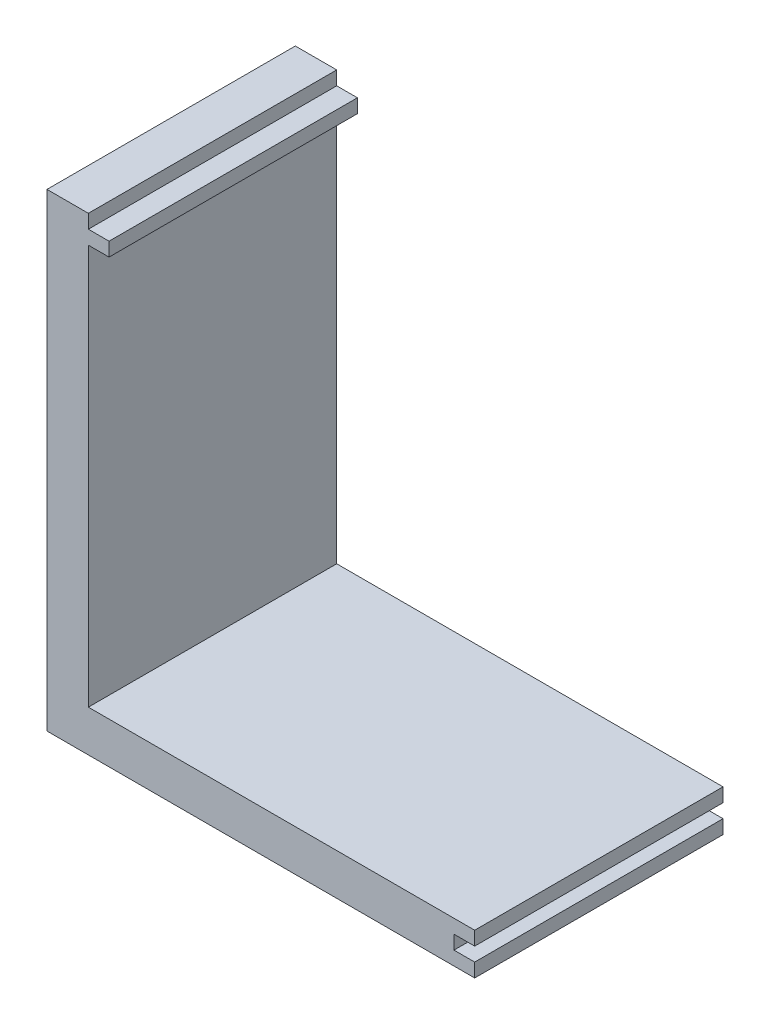
ISO-10303-21;
HEADER;
FILE_DESCRIPTION(('STEP AP214'),'2;1');
FILE_NAME('part.step','',(''),(''),'','','');
FILE_SCHEMA(('AUTOMOTIVE_DESIGN { 1 0 10303 214 1 1 1 1 }'));
ENDSEC;
DATA;
#1=APPLICATION_CONTEXT('core data for automotive mechanical design processes');
#2=APPLICATION_PROTOCOL_DEFINITION('international standard','automotive_design',2000,#1);
#3=PRODUCT_CONTEXT('',#1,'mechanical');
#4=PRODUCT('Part','Part','',(#3));
#5=PRODUCT_RELATED_PRODUCT_CATEGORY('part','',(#4));
#6=PRODUCT_DEFINITION_FORMATION('','',#4);
#7=PRODUCT_DEFINITION_CONTEXT('part definition',#1,'design');
#8=PRODUCT_DEFINITION('design','',#6,#7);
#9=PRODUCT_DEFINITION_SHAPE('','',#8);
#10=(LENGTH_UNIT() NAMED_UNIT(*) SI_UNIT(.MILLI.,.METRE.));
#11=(NAMED_UNIT(*) PLANE_ANGLE_UNIT() SI_UNIT($,.RADIAN.));
#12=(NAMED_UNIT(*) SI_UNIT($,.STERADIAN.) SOLID_ANGLE_UNIT());
#13=UNCERTAINTY_MEASURE_WITH_UNIT(LENGTH_MEASURE(1.E-05),#10,'distance_accuracy_value','');
#14=(GEOMETRIC_REPRESENTATION_CONTEXT(3) GLOBAL_UNCERTAINTY_ASSIGNED_CONTEXT((#13)) GLOBAL_UNIT_ASSIGNED_CONTEXT((#10,
#11,#12)) REPRESENTATION_CONTEXT('',''));
#15=CARTESIAN_POINT('',(0.,0.,0.));
#16=DIRECTION('',(0.,0.,1.));
#17=DIRECTION('',(1.,0.,0.));
#18=AXIS2_PLACEMENT_3D('',#15,#16,#17);
#19=CARTESIAN_POINT('',(0.,0.,18.));
#20=DIRECTION('',(-1.,0.,0.));
#21=DIRECTION('',(0.,0.,1.));
#22=AXIS2_PLACEMENT_3D('',#19,#20,#21);
#23=PLANE('',#22);
#24=DIRECTION('',(0.,1.,0.));
#25=VECTOR('',#24,1.);
#26=CARTESIAN_POINT('',(0.,0.,0.));
#27=LINE('',#26,#25);
#28=CARTESIAN_POINT('',(0.,0.,0.));
#29=VERTEX_POINT('',#28);
#30=CARTESIAN_POINT('',(0.,29.,0.));
#31=VERTEX_POINT('',#30);
#32=EDGE_CURVE('E221',#29,#31,#27,.T.);
#33=ORIENTED_EDGE('',*,*,#32,.T.);
#34=DIRECTION('',(0.,0.,1.));
#35=VECTOR('',#34,1.);
#36=CARTESIAN_POINT('',(0.,29.,0.));
#37=LINE('',#36,#35);
#38=CARTESIAN_POINT('',(0.,29.,18.));
#39=VERTEX_POINT('',#38);
#40=EDGE_CURVE('E64',#31,#39,#37,.T.);
#41=ORIENTED_EDGE('',*,*,#40,.T.);
#42=DIRECTION('',(0.,1.,0.));
#43=VECTOR('',#42,1.);
#44=CARTESIAN_POINT('',(0.,0.,18.));
#45=LINE('',#44,#43);
#46=CARTESIAN_POINT('',(0.,0.,18.));
#47=VERTEX_POINT('',#46);
#48=EDGE_CURVE('E205',#47,#39,#45,.T.);
#49=ORIENTED_EDGE('',*,*,#48,.F.);
#50=DIRECTION('',(0.,0.,-1.));
#51=VECTOR('',#50,1.);
#52=CARTESIAN_POINT('',(0.,0.,18.));
#53=LINE('',#52,#51);
#54=EDGE_CURVE('E49',#47,#29,#53,.T.);
#55=ORIENTED_EDGE('',*,*,#54,.T.);
#56=EDGE_LOOP('',(#33,#41,#49,#55));
#57=FACE_BOUND('',#56,.T.);
#58=ADVANCED_FACE('F41',(#57),#23,.F.);
#59=CARTESIAN_POINT('',(28.,0.,18.));
#60=DIRECTION('',(-1.,0.,0.));
#61=DIRECTION('',(0.,0.,1.));
#62=AXIS2_PLACEMENT_3D('',#59,#60,#61);
#63=PLANE('',#62);
#64=DIRECTION('',(0.,1.,0.));
#65=VECTOR('',#64,1.);
#66=CARTESIAN_POINT('',(28.,0.,0.));
#67=LINE('',#66,#65);
#68=CARTESIAN_POINT('',(28.,-3.,0.));
#69=VERTEX_POINT('',#68);
#70=CARTESIAN_POINT('',(28.,-2.,0.));
#71=VERTEX_POINT('',#70);
#72=EDGE_CURVE('E204',#69,#71,#67,.T.);
#73=ORIENTED_EDGE('',*,*,#72,.T.);
#74=DIRECTION('',(0.,0.,1.));
#75=VECTOR('',#74,1.);
#76=CARTESIAN_POINT('',(28.,-2.,18.));
#77=LINE('',#76,#75);
#78=CARTESIAN_POINT('',(28.,-2.,18.));
#79=VERTEX_POINT('',#78);
#80=EDGE_CURVE('E197',#71,#79,#77,.T.);
#81=ORIENTED_EDGE('',*,*,#80,.T.);
#82=DIRECTION('',(0.,1.,0.));
#83=VECTOR('',#82,1.);
#84=CARTESIAN_POINT('',(28.,0.,18.));
#85=LINE('',#84,#83);
#86=CARTESIAN_POINT('',(28.,-3.,18.));
#87=VERTEX_POINT('',#86);
#88=EDGE_CURVE('E214',#87,#79,#85,.T.);
#89=ORIENTED_EDGE('',*,*,#88,.F.);
#90=DIRECTION('',(0.,0.,-1.));
#91=VECTOR('',#90,1.);
#92=CARTESIAN_POINT('',(28.,-3.,18.));
#93=LINE('',#92,#91);
#94=EDGE_CURVE('E235',#87,#69,#93,.T.);
#95=ORIENTED_EDGE('',*,*,#94,.T.);
#96=EDGE_LOOP('',(#73,#81,#89,#95));
#97=FACE_BOUND('',#96,.T.);
#98=ADVANCED_FACE('F271',(#97),#63,.F.);
#99=CARTESIAN_POINT('',(0.,0.,18.));
#100=DIRECTION('',(0.,-1.,0.));
#101=DIRECTION('',(1.,0.,0.));
#102=AXIS2_PLACEMENT_3D('',#99,#100,#101);
#103=PLANE('',#102);
#104=DIRECTION('',(-1.,0.,0.));
#105=VECTOR('',#104,1.);
#106=CARTESIAN_POINT('',(0.,0.,0.));
#107=LINE('',#106,#105);
#108=CARTESIAN_POINT('',(28.,0.,0.));
#109=VERTEX_POINT('',#108);
#110=EDGE_CURVE('E200',#109,#29,#107,.T.);
#111=ORIENTED_EDGE('',*,*,#110,.T.);
#112=ORIENTED_EDGE('',*,*,#54,.F.);
#113=DIRECTION('',(-1.,0.,0.));
#114=VECTOR('',#113,1.);
#115=CARTESIAN_POINT('',(0.,0.,18.));
#116=LINE('',#115,#114);
#117=CARTESIAN_POINT('',(28.,0.,18.));
#118=VERTEX_POINT('',#117);
#119=EDGE_CURVE('E201',#118,#47,#116,.T.);
#120=ORIENTED_EDGE('',*,*,#119,.F.);
#121=DIRECTION('',(0.,0.,-1.));
#122=VECTOR('',#121,1.);
#123=CARTESIAN_POINT('',(28.,0.,18.));
#124=LINE('',#123,#122);
#125=EDGE_CURVE('E217',#118,#109,#124,.T.);
#126=ORIENTED_EDGE('',*,*,#125,.T.);
#127=EDGE_LOOP('',(#111,#112,#120,#126));
#128=FACE_BOUND('',#127,.T.);
#129=ADVANCED_FACE('F43',(#128),#103,.F.);
#130=CARTESIAN_POINT('',(0.,30.,18.));
#131=VERTEX_POINT('',#130);
#132=CARTESIAN_POINT('',(0.,31.,18.));
#133=VERTEX_POINT('',#132);
#134=EDGE_CURVE('E56',#131,#133,#45,.T.);
#135=ORIENTED_EDGE('',*,*,#134,.F.);
#136=DIRECTION('',(0.,0.,1.));
#137=VECTOR('',#136,1.);
#138=CARTESIAN_POINT('',(0.,30.,0.));
#139=LINE('',#138,#137);
#140=CARTESIAN_POINT('',(0.,30.,0.));
#141=VERTEX_POINT('',#140);
#142=EDGE_CURVE('E175',#141,#131,#139,.T.);
#143=ORIENTED_EDGE('',*,*,#142,.F.);
#144=CARTESIAN_POINT('',(0.,31.,0.));
#145=VERTEX_POINT('',#144);
#146=EDGE_CURVE('E220',#141,#145,#27,.T.);
#147=ORIENTED_EDGE('',*,*,#146,.T.);
#148=DIRECTION('',(0.,0.,-1.));
#149=VECTOR('',#148,1.);
#150=CARTESIAN_POINT('',(0.,31.,18.));
#151=LINE('',#150,#149);
#152=EDGE_CURVE('E244',#133,#145,#151,.T.);
#153=ORIENTED_EDGE('',*,*,#152,.F.);
#154=EDGE_LOOP('',(#135,#143,#147,#153));
#155=FACE_BOUND('',#154,.T.);
#156=ADVANCED_FACE('F287',(#155),#23,.F.);
#157=CARTESIAN_POINT('',(0.,31.,18.));
#158=DIRECTION('',(0.,-1.,0.));
#159=DIRECTION('',(0.,0.,-1.));
#160=AXIS2_PLACEMENT_3D('',#157,#158,#159);
#161=PLANE('',#160);
#162=DIRECTION('',(-1.,0.,0.));
#163=VECTOR('',#162,1.);
#164=CARTESIAN_POINT('',(0.,31.,0.));
#165=LINE('',#164,#163);
#166=CARTESIAN_POINT('',(-3.,31.,0.));
#167=VERTEX_POINT('',#166);
#168=EDGE_CURVE('E223',#145,#167,#165,.T.);
#169=ORIENTED_EDGE('',*,*,#168,.T.);
#170=DIRECTION('',(0.,0.,-1.));
#171=VECTOR('',#170,1.);
#172=CARTESIAN_POINT('',(-3.,31.,18.));
#173=LINE('',#172,#171);
#174=CARTESIAN_POINT('',(-3.,31.,18.));
#175=VERTEX_POINT('',#174);
#176=EDGE_CURVE('E241',#175,#167,#173,.T.);
#177=ORIENTED_EDGE('',*,*,#176,.F.);
#178=DIRECTION('',(-1.,0.,0.));
#179=VECTOR('',#178,1.);
#180=CARTESIAN_POINT('',(0.,31.,18.));
#181=LINE('',#180,#179);
#182=EDGE_CURVE('E207',#133,#175,#181,.T.);
#183=ORIENTED_EDGE('',*,*,#182,.F.);
#184=ORIENTED_EDGE('',*,*,#152,.T.);
#185=EDGE_LOOP('',(#169,#177,#183,#184));
#186=FACE_BOUND('',#185,.T.);
#187=ADVANCED_FACE('F286',(#186),#161,.F.);
#188=CARTESIAN_POINT('',(-3.,-3.,18.));
#189=DIRECTION('',(1.,0.,0.));
#190=DIRECTION('',(0.,1.,0.));
#191=AXIS2_PLACEMENT_3D('',#188,#189,#190);
#192=PLANE('',#191);
#193=DIRECTION('',(0.,-1.,0.));
#194=VECTOR('',#193,1.);
#195=CARTESIAN_POINT('',(-3.,-3.,0.));
#196=LINE('',#195,#194);
#197=CARTESIAN_POINT('',(-3.,-3.,0.));
#198=VERTEX_POINT('',#197);
#199=EDGE_CURVE('E225',#167,#198,#196,.T.);
#200=ORIENTED_EDGE('',*,*,#199,.T.);
#201=DIRECTION('',(0.,0.,-1.));
#202=VECTOR('',#201,1.);
#203=CARTESIAN_POINT('',(-3.,-3.,18.));
#204=LINE('',#203,#202);
#205=CARTESIAN_POINT('',(-3.,-3.,18.));
#206=VERTEX_POINT('',#205);
#207=EDGE_CURVE('E238',#206,#198,#204,.T.);
#208=ORIENTED_EDGE('',*,*,#207,.F.);
#209=DIRECTION('',(0.,-1.,0.));
#210=VECTOR('',#209,1.);
#211=CARTESIAN_POINT('',(-3.,-3.,18.));
#212=LINE('',#211,#210);
#213=EDGE_CURVE('E209',#175,#206,#212,.T.);
#214=ORIENTED_EDGE('',*,*,#213,.F.);
#215=ORIENTED_EDGE('',*,*,#176,.T.);
#216=EDGE_LOOP('',(#200,#208,#214,#215));
#217=FACE_BOUND('',#216,.T.);
#218=ADVANCED_FACE('F281',(#217),#192,.F.);
#219=CARTESIAN_POINT('',(0.,-3.,18.));
#220=DIRECTION('',(0.,1.,0.));
#221=DIRECTION('',(-1.,0.,0.));
#222=AXIS2_PLACEMENT_3D('',#219,#220,#221);
#223=PLANE('',#222);
#224=DIRECTION('',(1.,0.,0.));
#225=VECTOR('',#224,1.);
#226=CARTESIAN_POINT('',(0.,-3.,0.));
#227=LINE('',#226,#225);
#228=EDGE_CURVE('E228',#198,#69,#227,.T.);
#229=ORIENTED_EDGE('',*,*,#228,.T.);
#230=ORIENTED_EDGE('',*,*,#94,.F.);
#231=DIRECTION('',(1.,0.,0.));
#232=VECTOR('',#231,1.);
#233=CARTESIAN_POINT('',(0.,-3.,18.));
#234=LINE('',#233,#232);
#235=EDGE_CURVE('E211',#206,#87,#234,.T.);
#236=ORIENTED_EDGE('',*,*,#235,.F.);
#237=ORIENTED_EDGE('',*,*,#207,.T.);
#238=EDGE_LOOP('',(#229,#230,#236,#237));
#239=FACE_BOUND('',#238,.T.);
#240=ADVANCED_FACE('F276',(#239),#223,.F.);
#241=CARTESIAN_POINT('',(28.,-0.999999999999997,18.));
#242=VERTEX_POINT('',#241);
#243=EDGE_CURVE('E213',#242,#118,#85,.T.);
#244=ORIENTED_EDGE('',*,*,#243,.F.);
#245=DIRECTION('',(0.,0.,-1.));
#246=VECTOR('',#245,1.);
#247=CARTESIAN_POINT('',(28.,-0.999999999999997,18.));
#248=LINE('',#247,#246);
#249=CARTESIAN_POINT('',(28.,-0.999999999999997,0.));
#250=VERTEX_POINT('',#249);
#251=EDGE_CURVE('E192',#242,#250,#248,.T.);
#252=ORIENTED_EDGE('',*,*,#251,.T.);
#253=EDGE_CURVE('E230',#250,#109,#67,.T.);
#254=ORIENTED_EDGE('',*,*,#253,.T.);
#255=ORIENTED_EDGE('',*,*,#125,.F.);
#256=EDGE_LOOP('',(#244,#252,#254,#255));
#257=FACE_BOUND('',#256,.T.);
#258=ADVANCED_FACE('F256',(#257),#63,.F.);
#259=CARTESIAN_POINT('',(0.,0.,18.));
#260=DIRECTION('',(0.,0.,-1.));
#261=DIRECTION('',(-1.,0.,0.));
#262=AXIS2_PLACEMENT_3D('',#259,#260,#261);
#263=PLANE('',#262);
#264=ORIENTED_EDGE('',*,*,#88,.T.);
#265=DIRECTION('',(1.,0.,0.));
#266=VECTOR('',#265,1.);
#267=CARTESIAN_POINT('',(26.5,-2.,18.));
#268=LINE('',#267,#266);
#269=CARTESIAN_POINT('',(26.5,-2.,18.));
#270=VERTEX_POINT('',#269);
#271=EDGE_CURVE('E182',#270,#79,#268,.T.);
#272=ORIENTED_EDGE('',*,*,#271,.F.);
#273=DIRECTION('',(0.,-1.,0.));
#274=VECTOR('',#273,1.);
#275=CARTESIAN_POINT('',(26.5,-2.,18.));
#276=LINE('',#275,#274);
#277=CARTESIAN_POINT('',(26.5,-0.999999999999997,18.));
#278=VERTEX_POINT('',#277);
#279=EDGE_CURVE('E186',#278,#270,#276,.T.);
#280=ORIENTED_EDGE('',*,*,#279,.F.);
#281=DIRECTION('',(-1.,0.,0.));
#282=VECTOR('',#281,1.);
#283=CARTESIAN_POINT('',(26.5,-0.999999999999997,18.));
#284=LINE('',#283,#282);
#285=EDGE_CURVE('E174',#242,#278,#284,.T.);
#286=ORIENTED_EDGE('',*,*,#285,.F.);
#287=ORIENTED_EDGE('',*,*,#243,.T.);
#288=ORIENTED_EDGE('',*,*,#119,.T.);
#289=ORIENTED_EDGE('',*,*,#48,.T.);
#290=DIRECTION('',(1.,0.,0.));
#291=VECTOR('',#290,1.);
#292=CARTESIAN_POINT('',(0.,29.,18.));
#293=LINE('',#292,#291);
#294=CARTESIAN_POINT('',(1.5,29.,18.));
#295=VERTEX_POINT('',#294);
#296=EDGE_CURVE('E170',#39,#295,#293,.T.);
#297=ORIENTED_EDGE('',*,*,#296,.T.);
#298=DIRECTION('',(0.,1.,0.));
#299=VECTOR('',#298,1.);
#300=CARTESIAN_POINT('',(1.5,30.,18.));
#301=LINE('',#300,#299);
#302=CARTESIAN_POINT('',(1.5,30.,18.));
#303=VERTEX_POINT('',#302);
#304=EDGE_CURVE('E147',#295,#303,#301,.T.);
#305=ORIENTED_EDGE('',*,*,#304,.T.);
#306=DIRECTION('',(-1.,0.,0.));
#307=VECTOR('',#306,1.);
#308=CARTESIAN_POINT('',(0.,30.,18.));
#309=LINE('',#308,#307);
#310=EDGE_CURVE('E164',#303,#131,#309,.T.);
#311=ORIENTED_EDGE('',*,*,#310,.T.);
#312=ORIENTED_EDGE('',*,*,#134,.T.);
#313=ORIENTED_EDGE('',*,*,#182,.T.);
#314=ORIENTED_EDGE('',*,*,#213,.T.);
#315=ORIENTED_EDGE('',*,*,#235,.T.);
#316=EDGE_LOOP('',(#264,#272,#280,#286,#287,#288,#289,#297,#305,#311,#312,#313,#314,#315));
#317=FACE_BOUND('',#316,.T.);
#318=ADVANCED_FACE('F263',(#317),#263,.F.);
#319=CARTESIAN_POINT('',(0.,0.,0.));
#320=DIRECTION('',(0.,0.,-1.));
#321=DIRECTION('',(-1.,0.,0.));
#322=AXIS2_PLACEMENT_3D('',#319,#320,#321);
#323=PLANE('',#322);
#324=DIRECTION('',(1.,0.,0.));
#325=VECTOR('',#324,1.);
#326=CARTESIAN_POINT('',(26.5,-2.,0.));
#327=LINE('',#326,#325);
#328=CARTESIAN_POINT('',(26.5,-2.,0.));
#329=VERTEX_POINT('',#328);
#330=EDGE_CURVE('E181',#329,#71,#327,.T.);
#331=ORIENTED_EDGE('',*,*,#330,.T.);
#332=ORIENTED_EDGE('',*,*,#72,.F.);
#333=ORIENTED_EDGE('',*,*,#228,.F.);
#334=ORIENTED_EDGE('',*,*,#199,.F.);
#335=ORIENTED_EDGE('',*,*,#168,.F.);
#336=ORIENTED_EDGE('',*,*,#146,.F.);
#337=DIRECTION('',(-1.,0.,0.));
#338=VECTOR('',#337,1.);
#339=CARTESIAN_POINT('',(0.,30.,0.));
#340=LINE('',#339,#338);
#341=CARTESIAN_POINT('',(1.5,30.,0.));
#342=VERTEX_POINT('',#341);
#343=EDGE_CURVE('E153',#342,#141,#340,.T.);
#344=ORIENTED_EDGE('',*,*,#343,.F.);
#345=DIRECTION('',(0.,1.,0.));
#346=VECTOR('',#345,1.);
#347=CARTESIAN_POINT('',(1.5,30.,0.));
#348=LINE('',#347,#346);
#349=CARTESIAN_POINT('',(1.5,29.,0.));
#350=VERTEX_POINT('',#349);
#351=EDGE_CURVE('E145',#350,#342,#348,.T.);
#352=ORIENTED_EDGE('',*,*,#351,.F.);
#353=DIRECTION('',(1.,0.,0.));
#354=VECTOR('',#353,1.);
#355=CARTESIAN_POINT('',(0.,29.,0.));
#356=LINE('',#355,#354);
#357=EDGE_CURVE('E160',#31,#350,#356,.T.);
#358=ORIENTED_EDGE('',*,*,#357,.F.);
#359=ORIENTED_EDGE('',*,*,#32,.F.);
#360=ORIENTED_EDGE('',*,*,#110,.F.);
#361=ORIENTED_EDGE('',*,*,#253,.F.);
#362=DIRECTION('',(1.,0.,0.));
#363=VECTOR('',#362,1.);
#364=CARTESIAN_POINT('',(0.,-0.999999999999997,0.));
#365=LINE('',#364,#363);
#366=CARTESIAN_POINT('',(26.5,-0.999999999999997,0.));
#367=VERTEX_POINT('',#366);
#368=EDGE_CURVE('E11',#367,#250,#365,.T.);
#369=ORIENTED_EDGE('',*,*,#368,.F.);
#370=DIRECTION('',(0.,-1.,0.));
#371=VECTOR('',#370,1.);
#372=CARTESIAN_POINT('',(26.5,-2.,0.));
#373=LINE('',#372,#371);
#374=EDGE_CURVE('E178',#367,#329,#373,.T.);
#375=ORIENTED_EDGE('',*,*,#374,.T.);
#376=EDGE_LOOP('',(#331,#332,#333,#334,#335,#336,#344,#352,#358,#359,#360,#361,#369,#375));
#377=FACE_BOUND('',#376,.T.);
#378=ADVANCED_FACE('F159',(#377),#323,.T.);
#379=CARTESIAN_POINT('',(26.5,-2.,0.));
#380=DIRECTION('',(0.,-1.,0.));
#381=DIRECTION('',(0.,0.,-1.));
#382=AXIS2_PLACEMENT_3D('',#379,#380,#381);
#383=PLANE('',#382);
#384=ORIENTED_EDGE('',*,*,#330,.F.);
#385=DIRECTION('',(0.,0.,1.));
#386=VECTOR('',#385,1.);
#387=CARTESIAN_POINT('',(26.5,-2.,0.));
#388=LINE('',#387,#386);
#389=EDGE_CURVE('E190',#329,#270,#388,.T.);
#390=ORIENTED_EDGE('',*,*,#389,.T.);
#391=ORIENTED_EDGE('',*,*,#271,.T.);
#392=ORIENTED_EDGE('',*,*,#80,.F.);
#393=EDGE_LOOP('',(#384,#390,#391,#392));
#394=FACE_BOUND('',#393,.T.);
#395=ADVANCED_FACE('F342',(#394),#383,.F.);
#396=CARTESIAN_POINT('',(26.5,-0.999999999999997,0.));
#397=DIRECTION('',(0.,1.,0.));
#398=DIRECTION('',(0.,0.,1.));
#399=AXIS2_PLACEMENT_3D('',#396,#397,#398);
#400=PLANE('',#399);
#401=ORIENTED_EDGE('',*,*,#285,.T.);
#402=DIRECTION('',(0.,0.,1.));
#403=VECTOR('',#402,1.);
#404=CARTESIAN_POINT('',(26.5,-0.999999999999997,0.));
#405=LINE('',#404,#403);
#406=EDGE_CURVE('E184',#367,#278,#405,.T.);
#407=ORIENTED_EDGE('',*,*,#406,.F.);
#408=ORIENTED_EDGE('',*,*,#368,.T.);
#409=ORIENTED_EDGE('',*,*,#251,.F.);
#410=EDGE_LOOP('',(#401,#407,#408,#409));
#411=FACE_BOUND('',#410,.T.);
#412=ADVANCED_FACE('F259',(#411),#400,.F.);
#413=CARTESIAN_POINT('',(26.5,-2.,0.));
#414=DIRECTION('',(-1.,0.,0.));
#415=DIRECTION('',(0.,0.,1.));
#416=AXIS2_PLACEMENT_3D('',#413,#414,#415);
#417=PLANE('',#416);
#418=ORIENTED_EDGE('',*,*,#279,.T.);
#419=ORIENTED_EDGE('',*,*,#389,.F.);
#420=ORIENTED_EDGE('',*,*,#374,.F.);
#421=ORIENTED_EDGE('',*,*,#406,.T.);
#422=EDGE_LOOP('',(#418,#419,#420,#421));
#423=FACE_BOUND('',#422,.T.);
#424=ADVANCED_FACE('F266',(#423),#417,.F.);
#425=CARTESIAN_POINT('',(0.,29.,0.));
#426=DIRECTION('',(0.,-1.,0.));
#427=DIRECTION('',(0.,0.,-1.));
#428=AXIS2_PLACEMENT_3D('',#425,#426,#427);
#429=PLANE('',#428);
#430=ORIENTED_EDGE('',*,*,#296,.F.);
#431=ORIENTED_EDGE('',*,*,#40,.F.);
#432=ORIENTED_EDGE('',*,*,#357,.T.);
#433=DIRECTION('',(0.,0.,1.));
#434=VECTOR('',#433,1.);
#435=CARTESIAN_POINT('',(1.5,29.,0.));
#436=LINE('',#435,#434);
#437=EDGE_CURVE('E142',#350,#295,#436,.T.);
#438=ORIENTED_EDGE('',*,*,#437,.T.);
#439=EDGE_LOOP('',(#430,#431,#432,#438));
#440=FACE_BOUND('',#439,.T.);
#441=ADVANCED_FACE('F163',(#440),#429,.T.);
#442=CARTESIAN_POINT('',(0.,30.,0.));
#443=DIRECTION('',(0.,1.,0.));
#444=DIRECTION('',(0.,0.,1.));
#445=AXIS2_PLACEMENT_3D('',#442,#443,#444);
#446=PLANE('',#445);
#447=ORIENTED_EDGE('',*,*,#310,.F.);
#448=DIRECTION('',(0.,0.,1.));
#449=VECTOR('',#448,1.);
#450=CARTESIAN_POINT('',(1.5,30.,0.));
#451=LINE('',#450,#449);
#452=EDGE_CURVE('E152',#342,#303,#451,.T.);
#453=ORIENTED_EDGE('',*,*,#452,.F.);
#454=ORIENTED_EDGE('',*,*,#343,.T.);
#455=ORIENTED_EDGE('',*,*,#142,.T.);
#456=EDGE_LOOP('',(#447,#453,#454,#455));
#457=FACE_BOUND('',#456,.T.);
#458=ADVANCED_FACE('F290',(#457),#446,.T.);
#459=CARTESIAN_POINT('',(1.5,30.,0.));
#460=DIRECTION('',(1.,0.,0.));
#461=DIRECTION('',(0.,1.,0.));
#462=AXIS2_PLACEMENT_3D('',#459,#460,#461);
#463=PLANE('',#462);
#464=ORIENTED_EDGE('',*,*,#304,.F.);
#465=ORIENTED_EDGE('',*,*,#437,.F.);
#466=ORIENTED_EDGE('',*,*,#351,.T.);
#467=ORIENTED_EDGE('',*,*,#452,.T.);
#468=EDGE_LOOP('',(#464,#465,#466,#467));
#469=FACE_BOUND('',#468,.T.);
#470=ADVANCED_FACE('F144',(#469),#463,.T.);
#471=CLOSED_SHELL('',(#58,#98,#129,#156,#187,#218,#240,#258,#318,#378,#395,#412,#424,#441,#458,#470));
#472=MANIFOLD_SOLID_BREP('B2',#471);
#473=ADVANCED_BREP_SHAPE_REPRESENTATION('',(#18,#472),#14);
#474=SHAPE_DEFINITION_REPRESENTATION(#9,#473);
ENDSEC;
END-ISO-10303-21;
